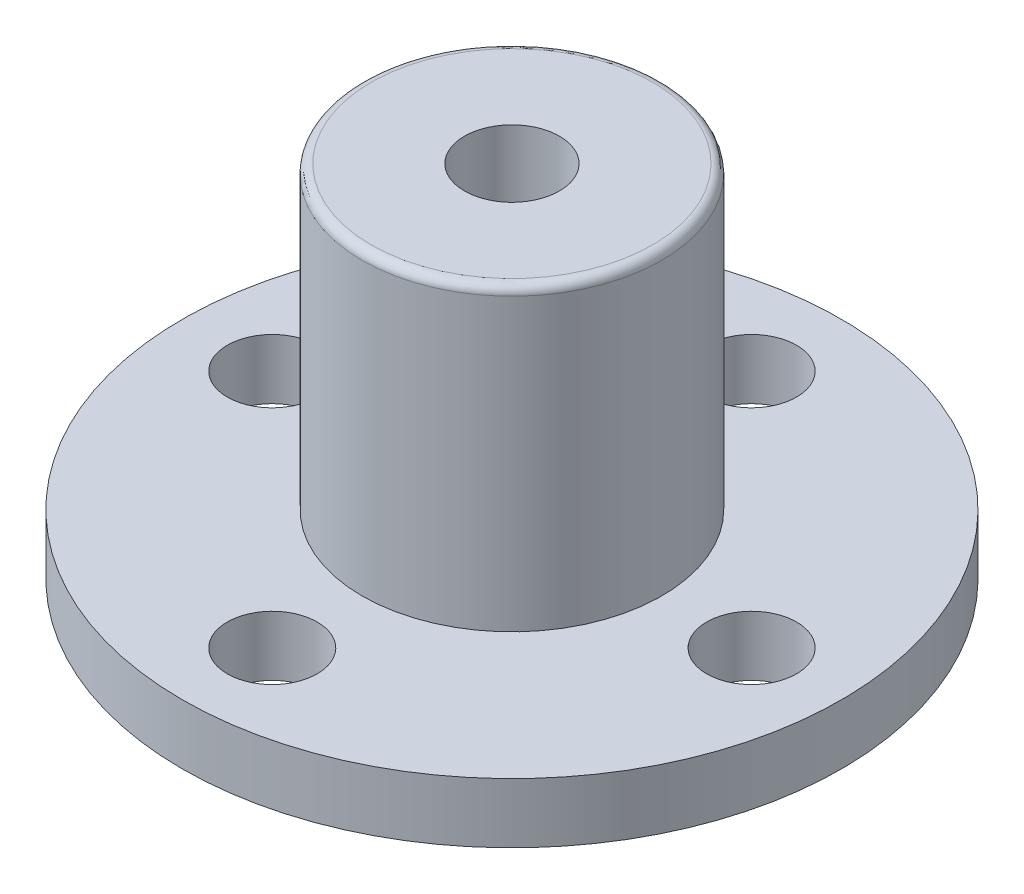
ISO-10303-21;
HEADER;
FILE_DESCRIPTION(('STEP AP214'),'2;1');
FILE_NAME('part.step','',(''),(''),'','','');
FILE_SCHEMA(('AUTOMOTIVE_DESIGN { 1 0 10303 214 1 1 1 1 }'));
ENDSEC;
DATA;
#1=APPLICATION_CONTEXT('core data for automotive mechanical design processes');
#2=APPLICATION_PROTOCOL_DEFINITION('international standard','automotive_design',2000,#1);
#3=PRODUCT_CONTEXT('',#1,'mechanical');
#4=PRODUCT('Part','Part','',(#3));
#5=PRODUCT_RELATED_PRODUCT_CATEGORY('part','',(#4));
#6=PRODUCT_DEFINITION_FORMATION('','',#4);
#7=PRODUCT_DEFINITION_CONTEXT('part definition',#1,'design');
#8=PRODUCT_DEFINITION('design','',#6,#7);
#9=PRODUCT_DEFINITION_SHAPE('','',#8);
#10=(LENGTH_UNIT() NAMED_UNIT(*) SI_UNIT(.MILLI.,.METRE.));
#11=(NAMED_UNIT(*) PLANE_ANGLE_UNIT() SI_UNIT($,.RADIAN.));
#12=(NAMED_UNIT(*) SI_UNIT($,.STERADIAN.) SOLID_ANGLE_UNIT());
#13=UNCERTAINTY_MEASURE_WITH_UNIT(LENGTH_MEASURE(1.E-05),#10,'distance_accuracy_value','');
#14=(GEOMETRIC_REPRESENTATION_CONTEXT(3) GLOBAL_UNCERTAINTY_ASSIGNED_CONTEXT((#13)) GLOBAL_UNIT_ASSIGNED_CONTEXT((#10,
#11,#12)) REPRESENTATION_CONTEXT('',''));
#15=CARTESIAN_POINT('',(0.,0.,0.));
#16=DIRECTION('',(0.,0.,1.));
#17=DIRECTION('',(1.,0.,0.));
#18=AXIS2_PLACEMENT_3D('',#15,#16,#17);
#19=CARTESIAN_POINT('',(0.,2.,0.));
#20=DIRECTION('',(0.,-1.,0.));
#21=DIRECTION('',(0.,0.,-1.));
#22=AXIS2_PLACEMENT_3D('',#19,#20,#21);
#23=CYLINDRICAL_SURFACE('',#22,11.);
#24=CARTESIAN_POINT('',(0.,2.,0.));
#25=DIRECTION('',(0.,1.,0.));
#26=DIRECTION('',(0.,0.,1.));
#27=AXIS2_PLACEMENT_3D('',#24,#25,#26);
#28=CIRCLE('',#27,11.);
#29=CARTESIAN_POINT('',(0.,2.,11.));
#30=VERTEX_POINT('',#29);
#31=EDGE_CURVE('E62',#30,#30,#28,.T.);
#32=ORIENTED_EDGE('',*,*,#31,.F.);
#33=EDGE_LOOP('',(#32));
#34=FACE_BOUND('',#33,.T.);
#35=CARTESIAN_POINT('',(0.,0.,0.));
#36=DIRECTION('',(0.,1.,0.));
#37=DIRECTION('',(0.,0.,1.));
#38=AXIS2_PLACEMENT_3D('',#35,#36,#37);
#39=CIRCLE('',#38,11.);
#40=CARTESIAN_POINT('',(0.,0.,11.));
#41=VERTEX_POINT('',#40);
#42=EDGE_CURVE('E58',#41,#41,#39,.T.);
#43=ORIENTED_EDGE('',*,*,#42,.T.);
#44=EDGE_LOOP('',(#43));
#45=FACE_BOUND('',#44,.T.);
#46=ADVANCED_FACE('F30',(#34,#45),#23,.T.);
#47=CARTESIAN_POINT('',(0.,2.,0.));
#48=DIRECTION('',(0.,1.,0.));
#49=DIRECTION('',(0.,0.,1.));
#50=AXIS2_PLACEMENT_3D('',#47,#48,#49);
#51=PLANE('',#50);
#52=CARTESIAN_POINT('',(0.,2.,-8.));
#53=DIRECTION('',(0.,1.,0.));
#54=DIRECTION('',(0.,0.,1.));
#55=AXIS2_PLACEMENT_3D('',#52,#53,#54);
#56=CIRCLE('',#55,1.5);
#57=CARTESIAN_POINT('',(0.,2.,-6.5));
#58=VERTEX_POINT('',#57);
#59=EDGE_CURVE('E51',#58,#58,#56,.T.);
#60=ORIENTED_EDGE('',*,*,#59,.F.);
#61=EDGE_LOOP('',(#60));
#62=FACE_BOUND('',#61,.T.);
#63=CARTESIAN_POINT('',(8.00000000000023,2.,-2.26393958003914E-13));
#64=DIRECTION('',(0.,1.,0.));
#65=DIRECTION('',(0.,0.,1.));
#66=AXIS2_PLACEMENT_3D('',#63,#64,#65);
#67=CIRCLE('',#66,1.50000000000018);
#68=CARTESIAN_POINT('',(8.00000000000023,2.,1.49999999999995));
#69=VERTEX_POINT('',#68);
#70=EDGE_CURVE('E77',#69,#69,#67,.T.);
#71=ORIENTED_EDGE('',*,*,#70,.F.);
#72=EDGE_LOOP('',(#71));
#73=FACE_BOUND('',#72,.T.);
#74=CARTESIAN_POINT('',(4.52787916007828E-13,2.,8.));
#75=DIRECTION('',(0.,1.,0.));
#76=DIRECTION('',(0.,0.,1.));
#77=AXIS2_PLACEMENT_3D('',#74,#75,#76);
#78=CIRCLE('',#77,1.50000000000049);
#79=CARTESIAN_POINT('',(4.52787916007828E-13,2.,9.50000000000049));
#80=VERTEX_POINT('',#79);
#81=EDGE_CURVE('E73',#80,#80,#78,.T.);
#82=ORIENTED_EDGE('',*,*,#81,.F.);
#83=EDGE_LOOP('',(#82));
#84=FACE_BOUND('',#83,.T.);
#85=CARTESIAN_POINT('',(-7.99999999999977,2.,2.27373675443232E-13));
#86=DIRECTION('',(0.,1.,0.));
#87=DIRECTION('',(0.,0.,1.));
#88=AXIS2_PLACEMENT_3D('',#85,#86,#87);
#89=CIRCLE('',#88,1.50000000000036);
#90=CARTESIAN_POINT('',(-7.99999999999977,2.,1.50000000000059));
#91=VERTEX_POINT('',#90);
#92=EDGE_CURVE('E70',#91,#91,#89,.T.);
#93=ORIENTED_EDGE('',*,*,#92,.F.);
#94=EDGE_LOOP('',(#93));
#95=FACE_BOUND('',#94,.T.);
#96=CARTESIAN_POINT('',(0.,2.,0.));
#97=DIRECTION('',(0.,1.,0.));
#98=DIRECTION('',(0.,0.,1.));
#99=AXIS2_PLACEMENT_3D('',#96,#97,#98);
#100=CIRCLE('',#99,5.);
#101=CARTESIAN_POINT('',(0.,2.,5.));
#102=VERTEX_POINT('',#101);
#103=EDGE_CURVE('E43',#102,#102,#100,.T.);
#104=ORIENTED_EDGE('',*,*,#103,.F.);
#105=EDGE_LOOP('',(#104));
#106=FACE_BOUND('',#105,.T.);
#107=ORIENTED_EDGE('',*,*,#31,.T.);
#108=EDGE_LOOP('',(#107));
#109=FACE_BOUND('',#108,.T.);
#110=ADVANCED_FACE('F108',(#62,#73,#84,#95,#106,#109),#51,.T.);
#111=CARTESIAN_POINT('',(0.,0.,0.));
#112=DIRECTION('',(0.,1.,0.));
#113=DIRECTION('',(0.,0.,1.));
#114=AXIS2_PLACEMENT_3D('',#111,#112,#113);
#115=PLANE('',#114);
#116=CARTESIAN_POINT('',(0.,0.,0.));
#117=DIRECTION('',(0.,1.,0.));
#118=DIRECTION('',(0.,0.,1.));
#119=AXIS2_PLACEMENT_3D('',#116,#117,#118);
#120=CIRCLE('',#119,1.585);
#121=CARTESIAN_POINT('',(0.,0.,1.585));
#122=VERTEX_POINT('',#121);
#123=EDGE_CURVE('E74',#122,#122,#120,.T.);
#124=ORIENTED_EDGE('',*,*,#123,.T.);
#125=EDGE_LOOP('',(#124));
#126=FACE_BOUND('',#125,.T.);
#127=CARTESIAN_POINT('',(0.,0.,-8.));
#128=DIRECTION('',(0.,1.,0.));
#129=DIRECTION('',(0.,0.,1.));
#130=AXIS2_PLACEMENT_3D('',#127,#128,#129);
#131=CIRCLE('',#130,1.5);
#132=CARTESIAN_POINT('',(0.,0.,-6.5));
#133=VERTEX_POINT('',#132);
#134=EDGE_CURVE('E34',#133,#133,#131,.T.);
#135=ORIENTED_EDGE('',*,*,#134,.T.);
#136=EDGE_LOOP('',(#135));
#137=FACE_BOUND('',#136,.T.);
#138=CARTESIAN_POINT('',(8.00000000000023,0.,-2.26393958003914E-13));
#139=DIRECTION('',(0.,1.,0.));
#140=DIRECTION('',(0.,0.,1.));
#141=AXIS2_PLACEMENT_3D('',#138,#139,#140);
#142=CIRCLE('',#141,1.50000000000018);
#143=CARTESIAN_POINT('',(8.00000000000023,0.,1.49999999999995));
#144=VERTEX_POINT('',#143);
#145=EDGE_CURVE('E53',#144,#144,#142,.T.);
#146=ORIENTED_EDGE('',*,*,#145,.T.);
#147=EDGE_LOOP('',(#146));
#148=FACE_BOUND('',#147,.T.);
#149=CARTESIAN_POINT('',(4.52787916007828E-13,0.,8.));
#150=DIRECTION('',(0.,1.,0.));
#151=DIRECTION('',(0.,0.,1.));
#152=AXIS2_PLACEMENT_3D('',#149,#150,#151);
#153=CIRCLE('',#152,1.50000000000049);
#154=CARTESIAN_POINT('',(4.52787916007828E-13,0.,9.50000000000049));
#155=VERTEX_POINT('',#154);
#156=EDGE_CURVE('E50',#155,#155,#153,.T.);
#157=ORIENTED_EDGE('',*,*,#156,.T.);
#158=EDGE_LOOP('',(#157));
#159=FACE_BOUND('',#158,.T.);
#160=CARTESIAN_POINT('',(-7.99999999999977,0.,2.27373675443232E-13));
#161=DIRECTION('',(0.,1.,0.));
#162=DIRECTION('',(0.,0.,1.));
#163=AXIS2_PLACEMENT_3D('',#160,#161,#162);
#164=CIRCLE('',#163,1.50000000000036);
#165=CARTESIAN_POINT('',(-7.99999999999977,0.,1.50000000000059));
#166=VERTEX_POINT('',#165);
#167=EDGE_CURVE('E47',#166,#166,#164,.T.);
#168=ORIENTED_EDGE('',*,*,#167,.T.);
#169=EDGE_LOOP('',(#168));
#170=FACE_BOUND('',#169,.T.);
#171=ORIENTED_EDGE('',*,*,#42,.F.);
#172=EDGE_LOOP('',(#171));
#173=FACE_BOUND('',#172,.T.);
#174=ADVANCED_FACE('F113',(#126,#137,#148,#159,#170,#173),#115,.F.);
#175=CARTESIAN_POINT('',(0.,12.,0.));
#176=DIRECTION('',(0.,-1.,0.));
#177=DIRECTION('',(0.,0.,-1.));
#178=AXIS2_PLACEMENT_3D('',#175,#176,#177);
#179=CYLINDRICAL_SURFACE('',#178,5.);
#180=CARTESIAN_POINT('',(0.,11.7,0.));
#181=DIRECTION('',(0.,1.,0.));
#182=DIRECTION('',(0.,0.,1.));
#183=AXIS2_PLACEMENT_3D('',#180,#181,#182);
#184=CIRCLE('',#183,5.);
#185=CARTESIAN_POINT('',(0.,11.7,5.));
#186=VERTEX_POINT('',#185);
#187=EDGE_CURVE('E10',#186,#186,#184,.F.);
#188=ORIENTED_EDGE('',*,*,#187,.T.);
#189=EDGE_LOOP('',(#188));
#190=FACE_BOUND('',#189,.T.);
#191=ORIENTED_EDGE('',*,*,#103,.T.);
#192=EDGE_LOOP('',(#191));
#193=FACE_BOUND('',#192,.T.);
#194=ADVANCED_FACE('F94',(#190,#193),#179,.T.);
#195=CARTESIAN_POINT('',(0.,12.,0.));
#196=DIRECTION('',(0.,1.,0.));
#197=DIRECTION('',(0.,0.,1.));
#198=AXIS2_PLACEMENT_3D('',#195,#196,#197);
#199=PLANE('',#198);
#200=CARTESIAN_POINT('',(0.,12.,0.));
#201=DIRECTION('',(0.,1.,0.));
#202=DIRECTION('',(0.,0.,1.));
#203=AXIS2_PLACEMENT_3D('',#200,#201,#202);
#204=CIRCLE('',#203,1.585);
#205=CARTESIAN_POINT('',(0.,12.,1.585));
#206=VERTEX_POINT('',#205);
#207=EDGE_CURVE('E84',#206,#206,#204,.T.);
#208=ORIENTED_EDGE('',*,*,#207,.F.);
#209=EDGE_LOOP('',(#208));
#210=FACE_BOUND('',#209,.T.);
#211=CARTESIAN_POINT('',(0.,12.,0.));
#212=DIRECTION('',(0.,1.,0.));
#213=DIRECTION('',(0.,0.,1.));
#214=AXIS2_PLACEMENT_3D('',#211,#212,#213);
#215=CIRCLE('',#214,4.7);
#216=CARTESIAN_POINT('',(0.,12.,4.7));
#217=VERTEX_POINT('',#216);
#218=EDGE_CURVE('E38',#217,#217,#215,.T.);
#219=ORIENTED_EDGE('',*,*,#218,.T.);
#220=EDGE_LOOP('',(#219));
#221=FACE_BOUND('',#220,.T.);
#222=ADVANCED_FACE('F91',(#210,#221),#199,.T.);
#223=CARTESIAN_POINT('',(0.,11.7,0.));
#224=DIRECTION('',(0.,1.,0.));
#225=DIRECTION('',(0.,0.,1.));
#226=AXIS2_PLACEMENT_3D('',#223,#224,#225);
#227=TOROIDAL_SURFACE('',#226,4.7,0.3);
#228=ORIENTED_EDGE('',*,*,#187,.F.);
#229=EDGE_LOOP('',(#228));
#230=FACE_BOUND('',#229,.T.);
#231=ORIENTED_EDGE('',*,*,#218,.F.);
#232=EDGE_LOOP('',(#231));
#233=FACE_BOUND('',#232,.T.);
#234=ADVANCED_FACE('F32',(#230,#233),#227,.T.);
#235=CARTESIAN_POINT('',(-7.99999999999977,-8.,2.27373675443232E-13));
#236=DIRECTION('',(0.,1.,0.));
#237=DIRECTION('',(0.,0.,1.));
#238=AXIS2_PLACEMENT_3D('',#235,#236,#237);
#239=CYLINDRICAL_SURFACE('',#238,1.50000000000036);
#240=ORIENTED_EDGE('',*,*,#92,.T.);
#241=EDGE_LOOP('',(#240));
#242=FACE_BOUND('',#241,.T.);
#243=ORIENTED_EDGE('',*,*,#167,.F.);
#244=EDGE_LOOP('',(#243));
#245=FACE_BOUND('',#244,.T.);
#246=ADVANCED_FACE('F99',(#242,#245),#239,.F.);
#247=CARTESIAN_POINT('',(4.52787916007828E-13,-8.,8.));
#248=DIRECTION('',(0.,1.,0.));
#249=DIRECTION('',(0.,0.,1.));
#250=AXIS2_PLACEMENT_3D('',#247,#248,#249);
#251=CYLINDRICAL_SURFACE('',#250,1.50000000000049);
#252=ORIENTED_EDGE('',*,*,#81,.T.);
#253=EDGE_LOOP('',(#252));
#254=FACE_BOUND('',#253,.T.);
#255=ORIENTED_EDGE('',*,*,#156,.F.);
#256=EDGE_LOOP('',(#255));
#257=FACE_BOUND('',#256,.T.);
#258=ADVANCED_FACE('F104',(#254,#257),#251,.F.);
#259=CARTESIAN_POINT('',(8.00000000000023,-8.,-2.26393958003914E-13));
#260=DIRECTION('',(0.,1.,0.));
#261=DIRECTION('',(0.,0.,1.));
#262=AXIS2_PLACEMENT_3D('',#259,#260,#261);
#263=CYLINDRICAL_SURFACE('',#262,1.50000000000018);
#264=ORIENTED_EDGE('',*,*,#70,.T.);
#265=EDGE_LOOP('',(#264));
#266=FACE_BOUND('',#265,.T.);
#267=ORIENTED_EDGE('',*,*,#145,.F.);
#268=EDGE_LOOP('',(#267));
#269=FACE_BOUND('',#268,.T.);
#270=ADVANCED_FACE('F125',(#266,#269),#263,.F.);
#271=CARTESIAN_POINT('',(0.,-8.,-8.));
#272=DIRECTION('',(0.,1.,0.));
#273=DIRECTION('',(0.,0.,1.));
#274=AXIS2_PLACEMENT_3D('',#271,#272,#273);
#275=CYLINDRICAL_SURFACE('',#274,1.5);
#276=ORIENTED_EDGE('',*,*,#59,.T.);
#277=EDGE_LOOP('',(#276));
#278=FACE_BOUND('',#277,.T.);
#279=ORIENTED_EDGE('',*,*,#134,.F.);
#280=EDGE_LOOP('',(#279));
#281=FACE_BOUND('',#280,.T.);
#282=ADVANCED_FACE('F129',(#278,#281),#275,.F.);
#283=CARTESIAN_POINT('',(0.,-8.,0.));
#284=DIRECTION('',(0.,1.,0.));
#285=DIRECTION('',(0.,0.,1.));
#286=AXIS2_PLACEMENT_3D('',#283,#284,#285);
#287=CYLINDRICAL_SURFACE('',#286,1.585);
#288=ORIENTED_EDGE('',*,*,#207,.T.);
#289=EDGE_LOOP('',(#288));
#290=FACE_BOUND('',#289,.T.);
#291=ORIENTED_EDGE('',*,*,#123,.F.);
#292=EDGE_LOOP('',(#291));
#293=FACE_BOUND('',#292,.T.);
#294=ADVANCED_FACE('F88',(#290,#293),#287,.F.);
#295=CLOSED_SHELL('',(#46,#110,#174,#194,#222,#234,#246,#258,#270,#282,#294));
#296=MANIFOLD_SOLID_BREP('B2',#295);
#297=ADVANCED_BREP_SHAPE_REPRESENTATION('',(#18,#296),#14);
#298=SHAPE_DEFINITION_REPRESENTATION(#9,#297);
ENDSEC;
END-ISO-10303-21;
